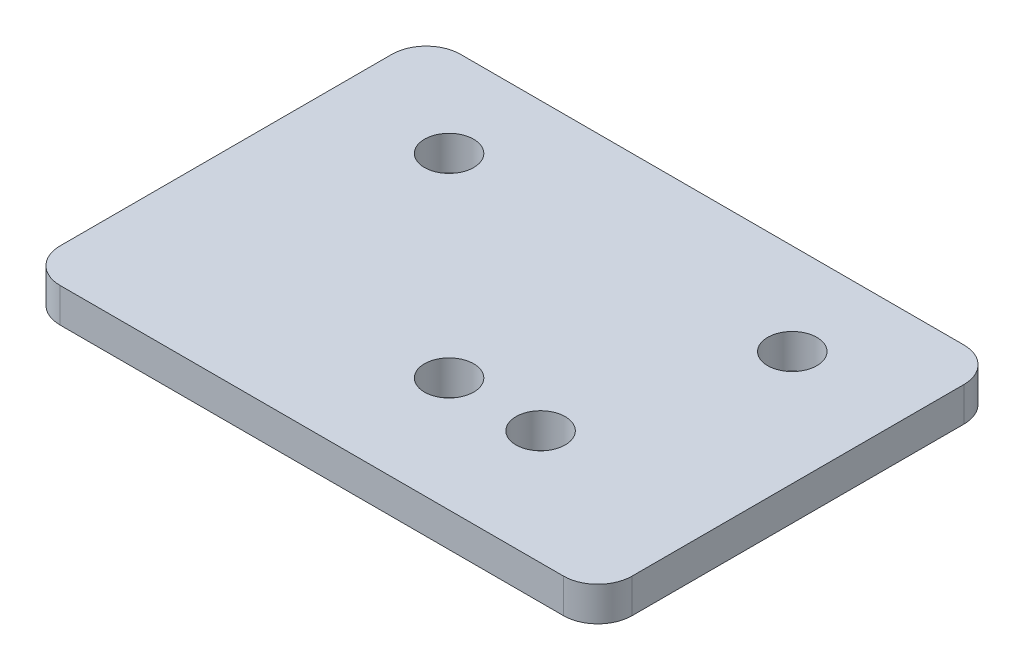
ISO-10303-21;
HEADER;
FILE_DESCRIPTION(('STEP AP214'),'2;1');
FILE_NAME('part.step','',(''),(''),'','','');
FILE_SCHEMA(('AUTOMOTIVE_DESIGN { 1 0 10303 214 1 1 1 1 }'));
ENDSEC;
DATA;
#1=APPLICATION_CONTEXT('core data for automotive mechanical design processes');
#2=APPLICATION_PROTOCOL_DEFINITION('international standard','automotive_design',2000,#1);
#3=PRODUCT_CONTEXT('',#1,'mechanical');
#4=PRODUCT('Part','Part','',(#3));
#5=PRODUCT_RELATED_PRODUCT_CATEGORY('part','',(#4));
#6=PRODUCT_DEFINITION_FORMATION('','',#4);
#7=PRODUCT_DEFINITION_CONTEXT('part definition',#1,'design');
#8=PRODUCT_DEFINITION('design','',#6,#7);
#9=PRODUCT_DEFINITION_SHAPE('','',#8);
#10=(LENGTH_UNIT() NAMED_UNIT(*) SI_UNIT(.MILLI.,.METRE.));
#11=(NAMED_UNIT(*) PLANE_ANGLE_UNIT() SI_UNIT($,.RADIAN.));
#12=(NAMED_UNIT(*) SI_UNIT($,.STERADIAN.) SOLID_ANGLE_UNIT());
#13=UNCERTAINTY_MEASURE_WITH_UNIT(LENGTH_MEASURE(1.E-05),#10,'distance_accuracy_value','');
#14=(GEOMETRIC_REPRESENTATION_CONTEXT(3) GLOBAL_UNCERTAINTY_ASSIGNED_CONTEXT((#13)) GLOBAL_UNIT_ASSIGNED_CONTEXT((#10,
#11,#12)) REPRESENTATION_CONTEXT('',''));
#15=CARTESIAN_POINT('',(0.,0.,0.));
#16=DIRECTION('',(0.,0.,1.));
#17=DIRECTION('',(1.,0.,0.));
#18=AXIS2_PLACEMENT_3D('',#15,#16,#17);
#19=CARTESIAN_POINT('',(25.,3.,17.5));
#20=DIRECTION('',(-1.,0.,0.));
#21=DIRECTION('',(0.,0.,1.));
#22=AXIS2_PLACEMENT_3D('',#19,#20,#21);
#23=PLANE('',#22);
#24=DIRECTION('',(0.,0.,-1.));
#25=VECTOR('',#24,1.);
#26=CARTESIAN_POINT('',(25.,3.,17.5));
#27=LINE('',#26,#25);
#28=CARTESIAN_POINT('',(25.,3.,14.5));
#29=VERTEX_POINT('',#28);
#30=CARTESIAN_POINT('',(25.,3.,-14.5));
#31=VERTEX_POINT('',#30);
#32=EDGE_CURVE('E120',#29,#31,#27,.T.);
#33=ORIENTED_EDGE('',*,*,#32,.F.);
#34=DIRECTION('',(0.,-1.,0.));
#35=VECTOR('',#34,1.);
#36=CARTESIAN_POINT('',(25.,3.,14.5));
#37=LINE('',#36,#35);
#38=CARTESIAN_POINT('',(25.,0.,14.5));
#39=VERTEX_POINT('',#38);
#40=EDGE_CURVE('E105',#29,#39,#37,.T.);
#41=ORIENTED_EDGE('',*,*,#40,.T.);
#42=DIRECTION('',(0.,0.,-1.));
#43=VECTOR('',#42,1.);
#44=CARTESIAN_POINT('',(25.,0.,17.5));
#45=LINE('',#44,#43);
#46=CARTESIAN_POINT('',(25.,0.,-14.5));
#47=VERTEX_POINT('',#46);
#48=EDGE_CURVE('E117',#39,#47,#45,.T.);
#49=ORIENTED_EDGE('',*,*,#48,.T.);
#50=DIRECTION('',(0.,-1.,0.));
#51=VECTOR('',#50,1.);
#52=CARTESIAN_POINT('',(25.,3.,-14.5));
#53=LINE('',#52,#51);
#54=EDGE_CURVE('E122',#47,#31,#53,.F.);
#55=ORIENTED_EDGE('',*,*,#54,.T.);
#56=EDGE_LOOP('',(#33,#41,#49,#55));
#57=FACE_BOUND('',#56,.T.);
#58=ADVANCED_FACE('F35',(#57),#23,.F.);
#59=CARTESIAN_POINT('',(-25.,3.,-17.5));
#60=DIRECTION('',(0.,0.,1.));
#61=DIRECTION('',(1.,0.,0.));
#62=AXIS2_PLACEMENT_3D('',#59,#60,#61);
#63=PLANE('',#62);
#64=DIRECTION('',(-1.,0.,0.));
#65=VECTOR('',#64,1.);
#66=CARTESIAN_POINT('',(-25.,0.,-17.5));
#67=LINE('',#66,#65);
#68=CARTESIAN_POINT('',(22.,0.,-17.5));
#69=VERTEX_POINT('',#68);
#70=CARTESIAN_POINT('',(-22.,0.,-17.5));
#71=VERTEX_POINT('',#70);
#72=EDGE_CURVE('E127',#69,#71,#67,.T.);
#73=ORIENTED_EDGE('',*,*,#72,.T.);
#74=DIRECTION('',(0.,-1.,0.));
#75=VECTOR('',#74,1.);
#76=CARTESIAN_POINT('',(-22.,3.,-17.5));
#77=LINE('',#76,#75);
#78=CARTESIAN_POINT('',(-22.,3.,-17.5));
#79=VERTEX_POINT('',#78);
#80=EDGE_CURVE('E11',#71,#79,#77,.F.);
#81=ORIENTED_EDGE('',*,*,#80,.T.);
#82=DIRECTION('',(-1.,0.,0.));
#83=VECTOR('',#82,1.);
#84=CARTESIAN_POINT('',(-25.,3.,-17.5));
#85=LINE('',#84,#83);
#86=CARTESIAN_POINT('',(22.,3.,-17.5));
#87=VERTEX_POINT('',#86);
#88=EDGE_CURVE('E166',#87,#79,#85,.T.);
#89=ORIENTED_EDGE('',*,*,#88,.F.);
#90=DIRECTION('',(0.,-1.,0.));
#91=VECTOR('',#90,1.);
#92=CARTESIAN_POINT('',(22.,3.,-17.5));
#93=LINE('',#92,#91);
#94=EDGE_CURVE('E43',#87,#69,#93,.T.);
#95=ORIENTED_EDGE('',*,*,#94,.T.);
#96=EDGE_LOOP('',(#73,#81,#89,#95));
#97=FACE_BOUND('',#96,.T.);
#98=ADVANCED_FACE('F164',(#97),#63,.F.);
#99=CARTESIAN_POINT('',(-25.,3.,17.5));
#100=DIRECTION('',(1.,0.,0.));
#101=DIRECTION('',(0.,0.,-1.));
#102=AXIS2_PLACEMENT_3D('',#99,#100,#101);
#103=PLANE('',#102);
#104=DIRECTION('',(0.,0.,1.));
#105=VECTOR('',#104,1.);
#106=CARTESIAN_POINT('',(-25.,3.,17.5));
#107=LINE('',#106,#105);
#108=CARTESIAN_POINT('',(-25.,3.,-14.5));
#109=VERTEX_POINT('',#108);
#110=CARTESIAN_POINT('',(-25.,3.,14.5));
#111=VERTEX_POINT('',#110);
#112=EDGE_CURVE('E174',#109,#111,#107,.T.);
#113=ORIENTED_EDGE('',*,*,#112,.F.);
#114=DIRECTION('',(0.,-1.,0.));
#115=VECTOR('',#114,1.);
#116=CARTESIAN_POINT('',(-25.,3.,-14.5));
#117=LINE('',#116,#115);
#118=CARTESIAN_POINT('',(-25.,0.,-14.5));
#119=VERTEX_POINT('',#118);
#120=EDGE_CURVE('E158',#109,#119,#117,.T.);
#121=ORIENTED_EDGE('',*,*,#120,.T.);
#122=DIRECTION('',(0.,0.,1.));
#123=VECTOR('',#122,1.);
#124=CARTESIAN_POINT('',(-25.,0.,17.5));
#125=LINE('',#124,#123);
#126=CARTESIAN_POINT('',(-25.,0.,14.5));
#127=VERTEX_POINT('',#126);
#128=EDGE_CURVE('E131',#119,#127,#125,.T.);
#129=ORIENTED_EDGE('',*,*,#128,.T.);
#130=DIRECTION('',(0.,-1.,0.));
#131=VECTOR('',#130,1.);
#132=CARTESIAN_POINT('',(-25.,3.,14.5));
#133=LINE('',#132,#131);
#134=EDGE_CURVE('E50',#127,#111,#133,.F.);
#135=ORIENTED_EDGE('',*,*,#134,.T.);
#136=EDGE_LOOP('',(#113,#121,#129,#135));
#137=FACE_BOUND('',#136,.T.);
#138=ADVANCED_FACE('F173',(#137),#103,.F.);
#139=CARTESIAN_POINT('',(-25.,3.,17.5));
#140=DIRECTION('',(0.,0.,-1.));
#141=DIRECTION('',(-1.,0.,0.));
#142=AXIS2_PLACEMENT_3D('',#139,#140,#141);
#143=PLANE('',#142);
#144=DIRECTION('',(1.,0.,0.));
#145=VECTOR('',#144,1.);
#146=CARTESIAN_POINT('',(-25.,0.,17.5));
#147=LINE('',#146,#145);
#148=CARTESIAN_POINT('',(-22.,0.,17.5));
#149=VERTEX_POINT('',#148);
#150=CARTESIAN_POINT('',(22.,0.,17.5));
#151=VERTEX_POINT('',#150);
#152=EDGE_CURVE('E141',#149,#151,#147,.T.);
#153=ORIENTED_EDGE('',*,*,#152,.T.);
#154=DIRECTION('',(0.,-1.,0.));
#155=VECTOR('',#154,1.);
#156=CARTESIAN_POINT('',(22.,3.,17.5));
#157=LINE('',#156,#155);
#158=CARTESIAN_POINT('',(22.,3.,17.5));
#159=VERTEX_POINT('',#158);
#160=EDGE_CURVE('E106',#151,#159,#157,.F.);
#161=ORIENTED_EDGE('',*,*,#160,.T.);
#162=DIRECTION('',(1.,0.,0.));
#163=VECTOR('',#162,1.);
#164=CARTESIAN_POINT('',(-25.,3.,17.5));
#165=LINE('',#164,#163);
#166=CARTESIAN_POINT('',(-22.,3.,17.5));
#167=VERTEX_POINT('',#166);
#168=EDGE_CURVE('E137',#167,#159,#165,.T.);
#169=ORIENTED_EDGE('',*,*,#168,.F.);
#170=DIRECTION('',(0.,-1.,0.));
#171=VECTOR('',#170,1.);
#172=CARTESIAN_POINT('',(-22.,3.,17.5));
#173=LINE('',#172,#171);
#174=EDGE_CURVE('E111',#167,#149,#173,.T.);
#175=ORIENTED_EDGE('',*,*,#174,.T.);
#176=EDGE_LOOP('',(#153,#161,#169,#175));
#177=FACE_BOUND('',#176,.T.);
#178=ADVANCED_FACE('F213',(#177),#143,.F.);
#179=CARTESIAN_POINT('',(0.,3.,0.));
#180=DIRECTION('',(0.,-1.,0.));
#181=DIRECTION('',(0.,0.,-1.));
#182=AXIS2_PLACEMENT_3D('',#179,#180,#181);
#183=PLANE('',#182);
#184=CARTESIAN_POINT('',(2.00000000000001,3.,7.5));
#185=DIRECTION('',(0.,1.,0.));
#186=DIRECTION('',(0.,0.,1.));
#187=AXIS2_PLACEMENT_3D('',#184,#185,#186);
#188=CIRCLE('',#187,2.15);
#189=CARTESIAN_POINT('',(2.00000000000001,3.,9.65));
#190=VERTEX_POINT('',#189);
#191=EDGE_CURVE('E195',#190,#190,#188,.T.);
#192=ORIENTED_EDGE('',*,*,#191,.F.);
#193=EDGE_LOOP('',(#192));
#194=FACE_BOUND('',#193,.T.);
#195=CARTESIAN_POINT('',(10.,3.,7.5));
#196=DIRECTION('',(0.,1.,0.));
#197=DIRECTION('',(0.,0.,1.));
#198=AXIS2_PLACEMENT_3D('',#195,#196,#197);
#199=CIRCLE('',#198,2.15);
#200=CARTESIAN_POINT('',(10.,3.,9.65));
#201=VERTEX_POINT('',#200);
#202=EDGE_CURVE('E189',#201,#201,#199,.T.);
#203=ORIENTED_EDGE('',*,*,#202,.F.);
#204=EDGE_LOOP('',(#203));
#205=FACE_BOUND('',#204,.T.);
#206=CARTESIAN_POINT('',(-15.,3.,-9.5));
#207=DIRECTION('',(0.,1.,0.));
#208=DIRECTION('',(0.,0.,1.));
#209=AXIS2_PLACEMENT_3D('',#206,#207,#208);
#210=CIRCLE('',#209,2.15);
#211=CARTESIAN_POINT('',(-15.,3.,-7.35));
#212=VERTEX_POINT('',#211);
#213=EDGE_CURVE('E134',#212,#212,#210,.T.);
#214=ORIENTED_EDGE('',*,*,#213,.F.);
#215=EDGE_LOOP('',(#214));
#216=FACE_BOUND('',#215,.T.);
#217=CARTESIAN_POINT('',(15.,3.,-9.5));
#218=DIRECTION('',(0.,1.,0.));
#219=DIRECTION('',(0.,0.,1.));
#220=AXIS2_PLACEMENT_3D('',#217,#218,#219);
#221=CIRCLE('',#220,2.15);
#222=CARTESIAN_POINT('',(15.,3.,-7.35));
#223=VERTEX_POINT('',#222);
#224=EDGE_CURVE('E180',#223,#223,#221,.T.);
#225=ORIENTED_EDGE('',*,*,#224,.F.);
#226=EDGE_LOOP('',(#225));
#227=FACE_BOUND('',#226,.T.);
#228=ORIENTED_EDGE('',*,*,#168,.T.);
#229=CARTESIAN_POINT('',(22.,3.,14.5));
#230=DIRECTION('',(0.,-1.,0.));
#231=DIRECTION('',(0.,0.,-1.));
#232=AXIS2_PLACEMENT_3D('',#229,#230,#231);
#233=CIRCLE('',#232,3.);
#234=EDGE_CURVE('E155',#159,#29,#233,.F.);
#235=ORIENTED_EDGE('',*,*,#234,.T.);
#236=ORIENTED_EDGE('',*,*,#32,.T.);
#237=CARTESIAN_POINT('',(22.,3.,-14.5));
#238=DIRECTION('',(0.,-1.,0.));
#239=DIRECTION('',(0.,0.,-1.));
#240=AXIS2_PLACEMENT_3D('',#237,#238,#239);
#241=CIRCLE('',#240,3.);
#242=EDGE_CURVE('E152',#31,#87,#241,.F.);
#243=ORIENTED_EDGE('',*,*,#242,.T.);
#244=ORIENTED_EDGE('',*,*,#88,.T.);
#245=CARTESIAN_POINT('',(-22.,3.,-14.5));
#246=DIRECTION('',(0.,-1.,0.));
#247=DIRECTION('',(0.,0.,-1.));
#248=AXIS2_PLACEMENT_3D('',#245,#246,#247);
#249=CIRCLE('',#248,3.);
#250=EDGE_CURVE('E57',#79,#109,#249,.F.);
#251=ORIENTED_EDGE('',*,*,#250,.T.);
#252=ORIENTED_EDGE('',*,*,#112,.T.);
#253=CARTESIAN_POINT('',(-22.,3.,14.5));
#254=DIRECTION('',(0.,-1.,0.));
#255=DIRECTION('',(0.,0.,-1.));
#256=AXIS2_PLACEMENT_3D('',#253,#254,#255);
#257=CIRCLE('',#256,3.);
#258=EDGE_CURVE('E150',#111,#167,#257,.F.);
#259=ORIENTED_EDGE('',*,*,#258,.T.);
#260=EDGE_LOOP('',(#228,#235,#236,#243,#244,#251,#252,#259));
#261=FACE_BOUND('',#260,.T.);
#262=ADVANCED_FACE('F210',(#194,#205,#216,#227,#261),#183,.F.);
#263=CARTESIAN_POINT('',(0.,0.,0.));
#264=DIRECTION('',(0.,-1.,0.));
#265=DIRECTION('',(0.,0.,-1.));
#266=AXIS2_PLACEMENT_3D('',#263,#264,#265);
#267=PLANE('',#266);
#268=CARTESIAN_POINT('',(2.00000000000001,0.,7.5));
#269=DIRECTION('',(0.,1.,0.));
#270=DIRECTION('',(0.,0.,1.));
#271=AXIS2_PLACEMENT_3D('',#268,#269,#270);
#272=CIRCLE('',#271,2.15);
#273=CARTESIAN_POINT('',(2.00000000000001,0.,9.65));
#274=VERTEX_POINT('',#273);
#275=EDGE_CURVE('E184',#274,#274,#272,.T.);
#276=ORIENTED_EDGE('',*,*,#275,.T.);
#277=EDGE_LOOP('',(#276));
#278=FACE_BOUND('',#277,.T.);
#279=CARTESIAN_POINT('',(10.,0.,7.5));
#280=DIRECTION('',(0.,1.,0.));
#281=DIRECTION('',(0.,0.,1.));
#282=AXIS2_PLACEMENT_3D('',#279,#280,#281);
#283=CIRCLE('',#282,2.15);
#284=CARTESIAN_POINT('',(10.,0.,9.65));
#285=VERTEX_POINT('',#284);
#286=EDGE_CURVE('E192',#285,#285,#283,.T.);
#287=ORIENTED_EDGE('',*,*,#286,.T.);
#288=EDGE_LOOP('',(#287));
#289=FACE_BOUND('',#288,.T.);
#290=CARTESIAN_POINT('',(-15.,0.,-9.5));
#291=DIRECTION('',(0.,1.,0.));
#292=DIRECTION('',(0.,0.,1.));
#293=AXIS2_PLACEMENT_3D('',#290,#291,#292);
#294=CIRCLE('',#293,2.15);
#295=CARTESIAN_POINT('',(-15.,0.,-7.35));
#296=VERTEX_POINT('',#295);
#297=EDGE_CURVE('E128',#296,#296,#294,.T.);
#298=ORIENTED_EDGE('',*,*,#297,.T.);
#299=EDGE_LOOP('',(#298));
#300=FACE_BOUND('',#299,.T.);
#301=CARTESIAN_POINT('',(15.,0.,-9.5));
#302=DIRECTION('',(0.,1.,0.));
#303=DIRECTION('',(0.,0.,1.));
#304=AXIS2_PLACEMENT_3D('',#301,#302,#303);
#305=CIRCLE('',#304,2.15);
#306=CARTESIAN_POINT('',(15.,0.,-7.35));
#307=VERTEX_POINT('',#306);
#308=EDGE_CURVE('E183',#307,#307,#305,.T.);
#309=ORIENTED_EDGE('',*,*,#308,.T.);
#310=EDGE_LOOP('',(#309));
#311=FACE_BOUND('',#310,.T.);
#312=ORIENTED_EDGE('',*,*,#48,.F.);
#313=CARTESIAN_POINT('',(22.,0.,14.5));
#314=DIRECTION('',(0.,-1.,0.));
#315=DIRECTION('',(0.,0.,-1.));
#316=AXIS2_PLACEMENT_3D('',#313,#314,#315);
#317=CIRCLE('',#316,3.);
#318=EDGE_CURVE('E101',#39,#151,#317,.T.);
#319=ORIENTED_EDGE('',*,*,#318,.T.);
#320=ORIENTED_EDGE('',*,*,#152,.F.);
#321=CARTESIAN_POINT('',(-22.,0.,14.5));
#322=DIRECTION('',(0.,-1.,0.));
#323=DIRECTION('',(0.,0.,-1.));
#324=AXIS2_PLACEMENT_3D('',#321,#322,#323);
#325=CIRCLE('',#324,3.);
#326=EDGE_CURVE('E121',#149,#127,#325,.T.);
#327=ORIENTED_EDGE('',*,*,#326,.T.);
#328=ORIENTED_EDGE('',*,*,#128,.F.);
#329=CARTESIAN_POINT('',(-22.,0.,-14.5));
#330=DIRECTION('',(0.,-1.,0.));
#331=DIRECTION('',(0.,0.,-1.));
#332=AXIS2_PLACEMENT_3D('',#329,#330,#331);
#333=CIRCLE('',#332,3.);
#334=EDGE_CURVE('E112',#119,#71,#333,.T.);
#335=ORIENTED_EDGE('',*,*,#334,.T.);
#336=ORIENTED_EDGE('',*,*,#72,.F.);
#337=CARTESIAN_POINT('',(22.,0.,-14.5));
#338=DIRECTION('',(0.,-1.,0.));
#339=DIRECTION('',(0.,0.,-1.));
#340=AXIS2_PLACEMENT_3D('',#337,#338,#339);
#341=CIRCLE('',#340,3.);
#342=EDGE_CURVE('E126',#69,#47,#341,.T.);
#343=ORIENTED_EDGE('',*,*,#342,.T.);
#344=EDGE_LOOP('',(#312,#319,#320,#327,#328,#335,#336,#343));
#345=FACE_BOUND('',#344,.T.);
#346=ADVANCED_FACE('F124',(#278,#289,#300,#311,#345),#267,.T.);
#347=CARTESIAN_POINT('',(15.,0.,-9.5));
#348=DIRECTION('',(0.,1.,0.));
#349=DIRECTION('',(0.,0.,1.));
#350=AXIS2_PLACEMENT_3D('',#347,#348,#349);
#351=CYLINDRICAL_SURFACE('',#350,2.15);
#352=ORIENTED_EDGE('',*,*,#308,.F.);
#353=EDGE_LOOP('',(#352));
#354=FACE_BOUND('',#353,.T.);
#355=ORIENTED_EDGE('',*,*,#224,.T.);
#356=EDGE_LOOP('',(#355));
#357=FACE_BOUND('',#356,.T.);
#358=ADVANCED_FACE('F283',(#354,#357),#351,.F.);
#359=CARTESIAN_POINT('',(-15.,0.,-9.5));
#360=DIRECTION('',(0.,1.,0.));
#361=DIRECTION('',(0.,0.,1.));
#362=AXIS2_PLACEMENT_3D('',#359,#360,#361);
#363=CYLINDRICAL_SURFACE('',#362,2.15);
#364=ORIENTED_EDGE('',*,*,#297,.F.);
#365=EDGE_LOOP('',(#364));
#366=FACE_BOUND('',#365,.T.);
#367=ORIENTED_EDGE('',*,*,#213,.T.);
#368=EDGE_LOOP('',(#367));
#369=FACE_BOUND('',#368,.T.);
#370=ADVANCED_FACE('F274',(#366,#369),#363,.F.);
#371=CARTESIAN_POINT('',(10.,0.,7.5));
#372=DIRECTION('',(0.,1.,0.));
#373=DIRECTION('',(0.,0.,1.));
#374=AXIS2_PLACEMENT_3D('',#371,#372,#373);
#375=CYLINDRICAL_SURFACE('',#374,2.15);
#376=ORIENTED_EDGE('',*,*,#286,.F.);
#377=EDGE_LOOP('',(#376));
#378=FACE_BOUND('',#377,.T.);
#379=ORIENTED_EDGE('',*,*,#202,.T.);
#380=EDGE_LOOP('',(#379));
#381=FACE_BOUND('',#380,.T.);
#382=ADVANCED_FACE('F206',(#378,#381),#375,.F.);
#383=CARTESIAN_POINT('',(2.00000000000001,0.,7.5));
#384=DIRECTION('',(0.,1.,0.));
#385=DIRECTION('',(0.,0.,1.));
#386=AXIS2_PLACEMENT_3D('',#383,#384,#385);
#387=CYLINDRICAL_SURFACE('',#386,2.15);
#388=ORIENTED_EDGE('',*,*,#275,.F.);
#389=EDGE_LOOP('',(#388));
#390=FACE_BOUND('',#389,.T.);
#391=ORIENTED_EDGE('',*,*,#191,.T.);
#392=EDGE_LOOP('',(#391));
#393=FACE_BOUND('',#392,.T.);
#394=ADVANCED_FACE('F203',(#390,#393),#387,.F.);
#395=CARTESIAN_POINT('',(22.,3.,14.5));
#396=DIRECTION('',(0.,-1.,0.));
#397=DIRECTION('',(0.,0.,-1.));
#398=AXIS2_PLACEMENT_3D('',#395,#396,#397);
#399=CYLINDRICAL_SURFACE('',#398,3.);
#400=ORIENTED_EDGE('',*,*,#234,.F.);
#401=ORIENTED_EDGE('',*,*,#160,.F.);
#402=ORIENTED_EDGE('',*,*,#318,.F.);
#403=ORIENTED_EDGE('',*,*,#40,.F.);
#404=EDGE_LOOP('',(#400,#401,#402,#403));
#405=FACE_BOUND('',#404,.T.);
#406=ADVANCED_FACE('F104',(#405),#399,.T.);
#407=CARTESIAN_POINT('',(-22.,3.,-14.5));
#408=DIRECTION('',(0.,-1.,0.));
#409=DIRECTION('',(0.,0.,-1.));
#410=AXIS2_PLACEMENT_3D('',#407,#408,#409);
#411=CYLINDRICAL_SURFACE('',#410,3.);
#412=ORIENTED_EDGE('',*,*,#250,.F.);
#413=ORIENTED_EDGE('',*,*,#80,.F.);
#414=ORIENTED_EDGE('',*,*,#334,.F.);
#415=ORIENTED_EDGE('',*,*,#120,.F.);
#416=EDGE_LOOP('',(#412,#413,#414,#415));
#417=FACE_BOUND('',#416,.T.);
#418=ADVANCED_FACE('F172',(#417),#411,.T.);
#419=CARTESIAN_POINT('',(22.,3.,-14.5));
#420=DIRECTION('',(0.,-1.,0.));
#421=DIRECTION('',(0.,0.,-1.));
#422=AXIS2_PLACEMENT_3D('',#419,#420,#421);
#423=CYLINDRICAL_SURFACE('',#422,3.);
#424=ORIENTED_EDGE('',*,*,#242,.F.);
#425=ORIENTED_EDGE('',*,*,#54,.F.);
#426=ORIENTED_EDGE('',*,*,#342,.F.);
#427=ORIENTED_EDGE('',*,*,#94,.F.);
#428=EDGE_LOOP('',(#424,#425,#426,#427));
#429=FACE_BOUND('',#428,.T.);
#430=ADVANCED_FACE('F225',(#429),#423,.T.);
#431=CARTESIAN_POINT('',(-22.,3.,14.5));
#432=DIRECTION('',(0.,-1.,0.));
#433=DIRECTION('',(0.,0.,-1.));
#434=AXIS2_PLACEMENT_3D('',#431,#432,#433);
#435=CYLINDRICAL_SURFACE('',#434,3.);
#436=ORIENTED_EDGE('',*,*,#258,.F.);
#437=ORIENTED_EDGE('',*,*,#134,.F.);
#438=ORIENTED_EDGE('',*,*,#326,.F.);
#439=ORIENTED_EDGE('',*,*,#174,.F.);
#440=EDGE_LOOP('',(#436,#437,#438,#439));
#441=FACE_BOUND('',#440,.T.);
#442=ADVANCED_FACE('F37',(#441),#435,.T.);
#443=CLOSED_SHELL('',(#58,#98,#138,#178,#262,#346,#358,#370,#382,#394,#406,#418,#430,#442));
#444=MANIFOLD_SOLID_BREP('B2',#443);
#445=ADVANCED_BREP_SHAPE_REPRESENTATION('',(#18,#444),#14);
#446=SHAPE_DEFINITION_REPRESENTATION(#9,#445);
ENDSEC;
END-ISO-10303-21;
